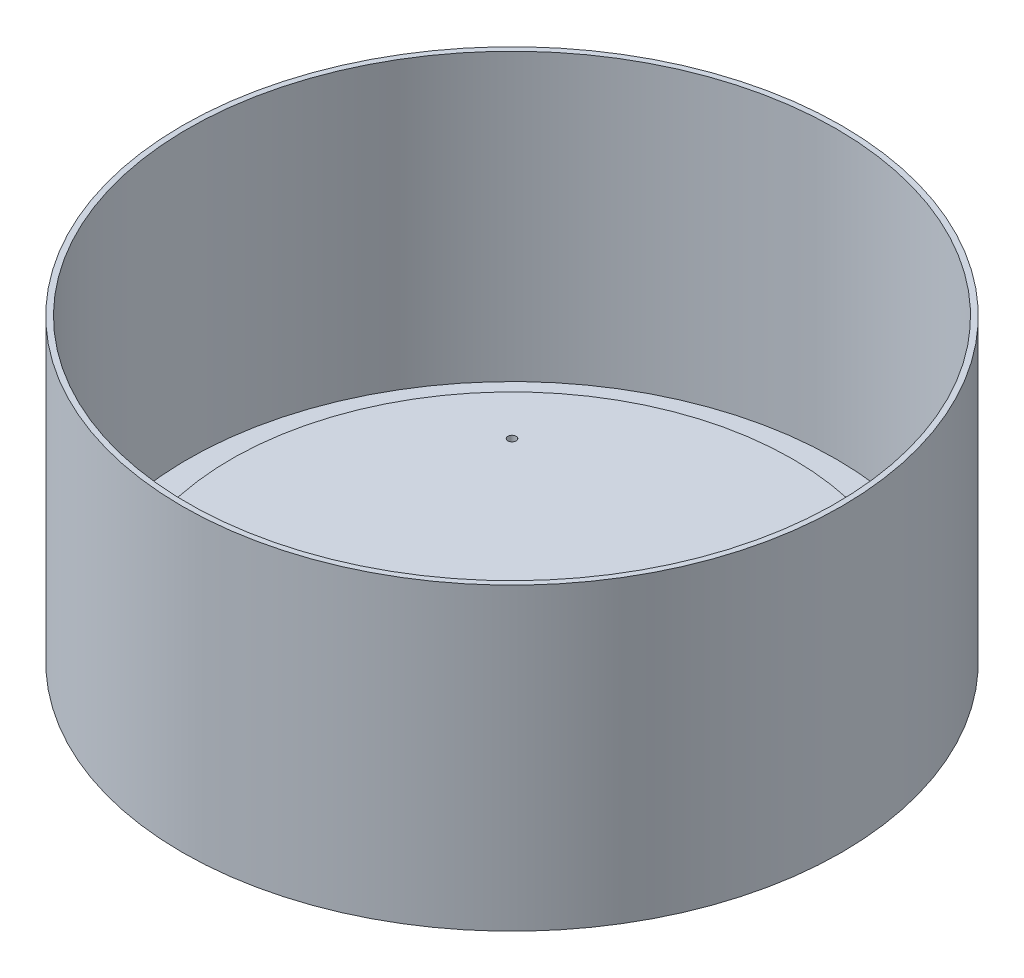
ISO-10303-21;
HEADER;
FILE_DESCRIPTION(('STEP AP214'),'2;1');
FILE_NAME('part.step','',(''),(''),'','','');
FILE_SCHEMA(('AUTOMOTIVE_DESIGN { 1 0 10303 214 1 1 1 1 }'));
ENDSEC;
DATA;
#1=APPLICATION_CONTEXT('core data for automotive mechanical design processes');
#2=APPLICATION_PROTOCOL_DEFINITION('international standard','automotive_design',2000,#1);
#3=PRODUCT_CONTEXT('',#1,'mechanical');
#4=PRODUCT('Part','Part','',(#3));
#5=PRODUCT_RELATED_PRODUCT_CATEGORY('part','',(#4));
#6=PRODUCT_DEFINITION_FORMATION('','',#4);
#7=PRODUCT_DEFINITION_CONTEXT('part definition',#1,'design');
#8=PRODUCT_DEFINITION('design','',#6,#7);
#9=PRODUCT_DEFINITION_SHAPE('','',#8);
#10=(LENGTH_UNIT() NAMED_UNIT(*) SI_UNIT(.MILLI.,.METRE.));
#11=(NAMED_UNIT(*) PLANE_ANGLE_UNIT() SI_UNIT($,.RADIAN.));
#12=(NAMED_UNIT(*) SI_UNIT($,.STERADIAN.) SOLID_ANGLE_UNIT());
#13=UNCERTAINTY_MEASURE_WITH_UNIT(LENGTH_MEASURE(1.E-05),#10,'distance_accuracy_value','');
#14=(GEOMETRIC_REPRESENTATION_CONTEXT(3) GLOBAL_UNCERTAINTY_ASSIGNED_CONTEXT((#13)) GLOBAL_UNIT_ASSIGNED_CONTEXT((#10,
#11,#12)) REPRESENTATION_CONTEXT('',''));
#15=CARTESIAN_POINT('',(0.,0.,0.));
#16=DIRECTION('',(0.,0.,1.));
#17=DIRECTION('',(1.,0.,0.));
#18=AXIS2_PLACEMENT_3D('',#15,#16,#17);
#19=CARTESIAN_POINT('',(0.,0.,0.));
#20=DIRECTION('',(0.,-1.,0.));
#21=DIRECTION('',(0.,0.,-1.));
#22=AXIS2_PLACEMENT_3D('',#19,#20,#21);
#23=PLANE('',#22);
#24=CARTESIAN_POINT('',(-58.,0.,58.));
#25=DIRECTION('',(0.,1.,0.));
#26=DIRECTION('',(0.,0.,1.));
#27=AXIS2_PLACEMENT_3D('',#24,#25,#26);
#28=CIRCLE('',#27,1.5);
#29=CARTESIAN_POINT('',(-58.,0.,59.5));
#30=VERTEX_POINT('',#29);
#31=EDGE_CURVE('E81',#30,#30,#28,.T.);
#32=ORIENTED_EDGE('',*,*,#31,.T.);
#33=EDGE_LOOP('',(#32));
#34=FACE_BOUND('',#33,.T.);
#35=CARTESIAN_POINT('',(58.,0.,58.));
#36=DIRECTION('',(0.,1.,0.));
#37=DIRECTION('',(0.,0.,1.));
#38=AXIS2_PLACEMENT_3D('',#35,#36,#37);
#39=CIRCLE('',#38,1.5);
#40=CARTESIAN_POINT('',(58.,0.,59.5));
#41=VERTEX_POINT('',#40);
#42=EDGE_CURVE('E75',#41,#41,#39,.T.);
#43=ORIENTED_EDGE('',*,*,#42,.T.);
#44=EDGE_LOOP('',(#43));
#45=FACE_BOUND('',#44,.T.);
#46=CARTESIAN_POINT('',(58.,0.,-58.));
#47=DIRECTION('',(0.,1.,0.));
#48=DIRECTION('',(0.,0.,1.));
#49=AXIS2_PLACEMENT_3D('',#46,#47,#48);
#50=CIRCLE('',#49,1.5);
#51=CARTESIAN_POINT('',(58.,0.,-56.5));
#52=VERTEX_POINT('',#51);
#53=EDGE_CURVE('E69',#52,#52,#50,.T.);
#54=ORIENTED_EDGE('',*,*,#53,.T.);
#55=EDGE_LOOP('',(#54));
#56=FACE_BOUND('',#55,.T.);
#57=CARTESIAN_POINT('',(-58.,0.,-58.));
#58=DIRECTION('',(0.,1.,0.));
#59=DIRECTION('',(0.,0.,1.));
#60=AXIS2_PLACEMENT_3D('',#57,#58,#59);
#61=CIRCLE('',#60,1.5);
#62=CARTESIAN_POINT('',(-58.,0.,-56.5));
#63=VERTEX_POINT('',#62);
#64=EDGE_CURVE('E65',#63,#63,#61,.T.);
#65=ORIENTED_EDGE('',*,*,#64,.T.);
#66=EDGE_LOOP('',(#65));
#67=FACE_BOUND('',#66,.T.);
#68=CARTESIAN_POINT('',(0.,0.,0.));
#69=DIRECTION('',(0.,-1.,0.));
#70=DIRECTION('',(0.,0.,-1.));
#71=AXIS2_PLACEMENT_3D('',#68,#69,#70);
#72=CIRCLE('',#71,121.);
#73=CARTESIAN_POINT('',(0.,0.,-121.));
#74=VERTEX_POINT('',#73);
#75=EDGE_CURVE('E10',#74,#74,#72,.T.);
#76=ORIENTED_EDGE('',*,*,#75,.T.);
#77=EDGE_LOOP('',(#76));
#78=FACE_BOUND('',#77,.T.);
#79=ADVANCED_FACE('F37',(#34,#45,#56,#67,#78),#23,.T.);
#80=CARTESIAN_POINT('',(0.,0.,0.));
#81=DIRECTION('',(0.,-1.,0.));
#82=DIRECTION('',(0.,0.,-1.));
#83=AXIS2_PLACEMENT_3D('',#80,#81,#82);
#84=CYLINDRICAL_SURFACE('',#83,121.);
#85=ORIENTED_EDGE('',*,*,#75,.F.);
#86=EDGE_LOOP('',(#85));
#87=FACE_BOUND('',#86,.T.);
#88=CARTESIAN_POINT('',(0.,110.,0.));
#89=DIRECTION('',(0.,-1.,0.));
#90=DIRECTION('',(0.,0.,-1.));
#91=AXIS2_PLACEMENT_3D('',#88,#89,#90);
#92=CIRCLE('',#91,121.);
#93=CARTESIAN_POINT('',(0.,110.,-121.));
#94=VERTEX_POINT('',#93);
#95=EDGE_CURVE('E43',#94,#94,#92,.T.);
#96=ORIENTED_EDGE('',*,*,#95,.T.);
#97=EDGE_LOOP('',(#96));
#98=FACE_BOUND('',#97,.T.);
#99=ADVANCED_FACE('F138',(#87,#98),#84,.T.);
#100=CARTESIAN_POINT('',(0.,110.,0.));
#101=DIRECTION('',(0.,-1.,0.));
#102=DIRECTION('',(0.,0.,-1.));
#103=AXIS2_PLACEMENT_3D('',#100,#101,#102);
#104=PLANE('',#103);
#105=ORIENTED_EDGE('',*,*,#95,.F.);
#106=EDGE_LOOP('',(#105));
#107=FACE_BOUND('',#106,.T.);
#108=CARTESIAN_POINT('',(0.,110.,0.));
#109=DIRECTION('',(0.,-1.,0.));
#110=DIRECTION('',(0.,0.,-1.));
#111=AXIS2_PLACEMENT_3D('',#108,#109,#110);
#112=CIRCLE('',#111,119.);
#113=CARTESIAN_POINT('',(0.,110.,-119.));
#114=VERTEX_POINT('',#113);
#115=EDGE_CURVE('E47',#114,#114,#112,.T.);
#116=ORIENTED_EDGE('',*,*,#115,.T.);
#117=EDGE_LOOP('',(#116));
#118=FACE_BOUND('',#117,.T.);
#119=ADVANCED_FACE('F132',(#107,#118),#104,.F.);
#120=CARTESIAN_POINT('',(0.,0.,0.));
#121=DIRECTION('',(0.,-1.,0.));
#122=DIRECTION('',(0.,0.,-1.));
#123=AXIS2_PLACEMENT_3D('',#120,#121,#122);
#124=CYLINDRICAL_SURFACE('',#123,119.);
#125=ORIENTED_EDGE('',*,*,#115,.F.);
#126=EDGE_LOOP('',(#125));
#127=FACE_BOUND('',#126,.T.);
#128=CARTESIAN_POINT('',(0.,5.,0.));
#129=DIRECTION('',(0.,-1.,0.));
#130=DIRECTION('',(0.,0.,-1.));
#131=AXIS2_PLACEMENT_3D('',#128,#129,#130);
#132=CIRCLE('',#131,119.);
#133=CARTESIAN_POINT('',(0.,5.,-119.));
#134=VERTEX_POINT('',#133);
#135=EDGE_CURVE('E51',#134,#134,#132,.T.);
#136=ORIENTED_EDGE('',*,*,#135,.T.);
#137=EDGE_LOOP('',(#136));
#138=FACE_BOUND('',#137,.T.);
#139=ADVANCED_FACE('F127',(#127,#138),#124,.F.);
#140=CARTESIAN_POINT('',(0.,5.,0.));
#141=DIRECTION('',(0.,1.,0.));
#142=DIRECTION('',(0.,0.,1.));
#143=AXIS2_PLACEMENT_3D('',#140,#141,#142);
#144=PLANE('',#143);
#145=CARTESIAN_POINT('',(0.,5.,0.));
#146=DIRECTION('',(0.,-1.,0.));
#147=DIRECTION('',(0.,0.,-1.));
#148=AXIS2_PLACEMENT_3D('',#145,#146,#147);
#149=CIRCLE('',#148,107.);
#150=CARTESIAN_POINT('',(0.,5.,-107.));
#151=VERTEX_POINT('',#150);
#152=EDGE_CURVE('E56',#151,#151,#149,.T.);
#153=ORIENTED_EDGE('',*,*,#152,.T.);
#154=EDGE_LOOP('',(#153));
#155=FACE_BOUND('',#154,.T.);
#156=ORIENTED_EDGE('',*,*,#135,.F.);
#157=EDGE_LOOP('',(#156));
#158=FACE_BOUND('',#157,.T.);
#159=ADVANCED_FACE('F121',(#155,#158),#144,.T.);
#160=CARTESIAN_POINT('',(0.,5.,0.));
#161=DIRECTION('',(0.,-1.,0.));
#162=DIRECTION('',(0.,0.,-1.));
#163=AXIS2_PLACEMENT_3D('',#160,#161,#162);
#164=CONICAL_SURFACE('',#163,107.,0.674740942223553);
#165=CARTESIAN_POINT('',(0.,9.99999999999999,0.));
#166=DIRECTION('',(0.,-1.,0.));
#167=DIRECTION('',(0.,0.,-1.));
#168=AXIS2_PLACEMENT_3D('',#165,#166,#167);
#169=CIRCLE('',#168,103.);
#170=CARTESIAN_POINT('',(0.,9.99999999999999,-103.));
#171=VERTEX_POINT('',#170);
#172=EDGE_CURVE('E59',#171,#171,#169,.T.);
#173=ORIENTED_EDGE('',*,*,#172,.T.);
#174=EDGE_LOOP('',(#173));
#175=FACE_BOUND('',#174,.T.);
#176=ORIENTED_EDGE('',*,*,#152,.F.);
#177=EDGE_LOOP('',(#176));
#178=FACE_BOUND('',#177,.T.);
#179=ADVANCED_FACE('F115',(#175,#178),#164,.T.);
#180=CARTESIAN_POINT('',(0.,0.,0.));
#181=DIRECTION('',(0.,-1.,0.));
#182=DIRECTION('',(0.,0.,-1.));
#183=AXIS2_PLACEMENT_3D('',#180,#181,#182);
#184=CYLINDRICAL_SURFACE('',#183,103.);
#185=CARTESIAN_POINT('',(0.,13.03,0.));
#186=DIRECTION('',(0.,-1.,0.));
#187=DIRECTION('',(0.,0.,-1.));
#188=AXIS2_PLACEMENT_3D('',#185,#186,#187);
#189=CIRCLE('',#188,103.);
#190=CARTESIAN_POINT('',(0.,13.03,-103.));
#191=VERTEX_POINT('',#190);
#192=EDGE_CURVE('E62',#191,#191,#189,.T.);
#193=ORIENTED_EDGE('',*,*,#192,.T.);
#194=EDGE_LOOP('',(#193));
#195=FACE_BOUND('',#194,.T.);
#196=ORIENTED_EDGE('',*,*,#172,.F.);
#197=EDGE_LOOP('',(#196));
#198=FACE_BOUND('',#197,.T.);
#199=ADVANCED_FACE('F103',(#195,#198),#184,.T.);
#200=CARTESIAN_POINT('',(0.,13.03,0.));
#201=DIRECTION('',(0.,1.,0.));
#202=DIRECTION('',(0.,0.,1.));
#203=AXIS2_PLACEMENT_3D('',#200,#201,#202);
#204=PLANE('',#203);
#205=CARTESIAN_POINT('',(-58.,13.03,58.));
#206=DIRECTION('',(0.,1.,0.));
#207=DIRECTION('',(0.,0.,1.));
#208=AXIS2_PLACEMENT_3D('',#205,#206,#207);
#209=CIRCLE('',#208,1.5);
#210=CARTESIAN_POINT('',(-58.,13.03,59.5));
#211=VERTEX_POINT('',#210);
#212=EDGE_CURVE('E84',#211,#211,#209,.T.);
#213=ORIENTED_EDGE('',*,*,#212,.F.);
#214=EDGE_LOOP('',(#213));
#215=FACE_BOUND('',#214,.T.);
#216=CARTESIAN_POINT('',(58.,13.03,58.));
#217=DIRECTION('',(0.,1.,0.));
#218=DIRECTION('',(0.,0.,1.));
#219=AXIS2_PLACEMENT_3D('',#216,#217,#218);
#220=CIRCLE('',#219,1.5);
#221=CARTESIAN_POINT('',(58.,13.03,59.5));
#222=VERTEX_POINT('',#221);
#223=EDGE_CURVE('E78',#222,#222,#220,.T.);
#224=ORIENTED_EDGE('',*,*,#223,.F.);
#225=EDGE_LOOP('',(#224));
#226=FACE_BOUND('',#225,.T.);
#227=CARTESIAN_POINT('',(58.,13.03,-58.));
#228=DIRECTION('',(0.,1.,0.));
#229=DIRECTION('',(0.,0.,1.));
#230=AXIS2_PLACEMENT_3D('',#227,#228,#229);
#231=CIRCLE('',#230,1.5);
#232=CARTESIAN_POINT('',(58.,13.03,-56.5));
#233=VERTEX_POINT('',#232);
#234=EDGE_CURVE('E72',#233,#233,#231,.T.);
#235=ORIENTED_EDGE('',*,*,#234,.F.);
#236=EDGE_LOOP('',(#235));
#237=FACE_BOUND('',#236,.T.);
#238=CARTESIAN_POINT('',(-58.,13.03,-58.));
#239=DIRECTION('',(0.,1.,0.));
#240=DIRECTION('',(0.,0.,1.));
#241=AXIS2_PLACEMENT_3D('',#238,#239,#240);
#242=CIRCLE('',#241,1.5);
#243=CARTESIAN_POINT('',(-58.,13.03,-56.5));
#244=VERTEX_POINT('',#243);
#245=EDGE_CURVE('E66',#244,#244,#242,.T.);
#246=ORIENTED_EDGE('',*,*,#245,.F.);
#247=EDGE_LOOP('',(#246));
#248=FACE_BOUND('',#247,.T.);
#249=ORIENTED_EDGE('',*,*,#192,.F.);
#250=EDGE_LOOP('',(#249));
#251=FACE_BOUND('',#250,.T.);
#252=ADVANCED_FACE('F99',(#215,#226,#237,#248,#251),#204,.T.);
#253=CARTESIAN_POINT('',(-58.,0.,-58.));
#254=DIRECTION('',(0.,1.,0.));
#255=DIRECTION('',(0.,0.,1.));
#256=AXIS2_PLACEMENT_3D('',#253,#254,#255);
#257=CYLINDRICAL_SURFACE('',#256,1.5);
#258=ORIENTED_EDGE('',*,*,#64,.F.);
#259=EDGE_LOOP('',(#258));
#260=FACE_BOUND('',#259,.T.);
#261=ORIENTED_EDGE('',*,*,#245,.T.);
#262=EDGE_LOOP('',(#261));
#263=FACE_BOUND('',#262,.T.);
#264=ADVANCED_FACE('F102',(#260,#263),#257,.F.);
#265=CARTESIAN_POINT('',(58.,0.,-58.));
#266=DIRECTION('',(0.,1.,0.));
#267=DIRECTION('',(0.,0.,1.));
#268=AXIS2_PLACEMENT_3D('',#265,#266,#267);
#269=CYLINDRICAL_SURFACE('',#268,1.5);
#270=ORIENTED_EDGE('',*,*,#53,.F.);
#271=EDGE_LOOP('',(#270));
#272=FACE_BOUND('',#271,.T.);
#273=ORIENTED_EDGE('',*,*,#234,.T.);
#274=EDGE_LOOP('',(#273));
#275=FACE_BOUND('',#274,.T.);
#276=ADVANCED_FACE('F196',(#272,#275),#269,.F.);
#277=CARTESIAN_POINT('',(58.,0.,58.));
#278=DIRECTION('',(0.,1.,0.));
#279=DIRECTION('',(0.,0.,1.));
#280=AXIS2_PLACEMENT_3D('',#277,#278,#279);
#281=CYLINDRICAL_SURFACE('',#280,1.5);
#282=ORIENTED_EDGE('',*,*,#42,.F.);
#283=EDGE_LOOP('',(#282));
#284=FACE_BOUND('',#283,.T.);
#285=ORIENTED_EDGE('',*,*,#223,.T.);
#286=EDGE_LOOP('',(#285));
#287=FACE_BOUND('',#286,.T.);
#288=ADVANCED_FACE('F95',(#284,#287),#281,.F.);
#289=CARTESIAN_POINT('',(-58.,0.,58.));
#290=DIRECTION('',(0.,1.,0.));
#291=DIRECTION('',(0.,0.,1.));
#292=AXIS2_PLACEMENT_3D('',#289,#290,#291);
#293=CYLINDRICAL_SURFACE('',#292,1.5);
#294=ORIENTED_EDGE('',*,*,#31,.F.);
#295=EDGE_LOOP('',(#294));
#296=FACE_BOUND('',#295,.T.);
#297=ORIENTED_EDGE('',*,*,#212,.T.);
#298=EDGE_LOOP('',(#297));
#299=FACE_BOUND('',#298,.T.);
#300=ADVANCED_FACE('F92',(#296,#299),#293,.F.);
#301=CLOSED_SHELL('',(#79,#99,#119,#139,#159,#179,#199,#252,#264,#276,#288,#300));
#302=MANIFOLD_SOLID_BREP('B2',#301);
#303=ADVANCED_BREP_SHAPE_REPRESENTATION('',(#18,#302),#14);
#304=SHAPE_DEFINITION_REPRESENTATION(#9,#303);
ENDSEC;
END-ISO-10303-21;
